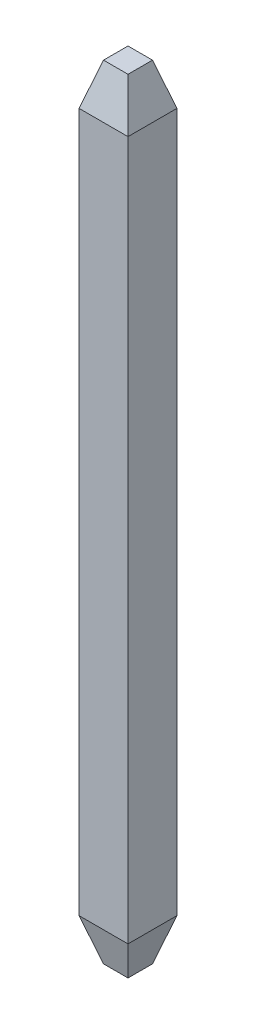
ISO-10303-21;
HEADER;
FILE_DESCRIPTION(('STEP AP214'),'2;1');
FILE_NAME('part.step','',(''),(''),'','','');
FILE_SCHEMA(('AUTOMOTIVE_DESIGN { 1 0 10303 214 1 1 1 1 }'));
ENDSEC;
DATA;
#1=APPLICATION_CONTEXT('core data for automotive mechanical design processes');
#2=APPLICATION_PROTOCOL_DEFINITION('international standard','automotive_design',2000,#1);
#3=PRODUCT_CONTEXT('',#1,'mechanical');
#4=PRODUCT('Part','Part','',(#3));
#5=PRODUCT_RELATED_PRODUCT_CATEGORY('part','',(#4));
#6=PRODUCT_DEFINITION_FORMATION('','',#4);
#7=PRODUCT_DEFINITION_CONTEXT('part definition',#1,'design');
#8=PRODUCT_DEFINITION('design','',#6,#7);
#9=PRODUCT_DEFINITION_SHAPE('','',#8);
#10=(LENGTH_UNIT() NAMED_UNIT(*) SI_UNIT(.MILLI.,.METRE.));
#11=(NAMED_UNIT(*) PLANE_ANGLE_UNIT() SI_UNIT($,.RADIAN.));
#12=(NAMED_UNIT(*) SI_UNIT($,.STERADIAN.) SOLID_ANGLE_UNIT());
#13=UNCERTAINTY_MEASURE_WITH_UNIT(LENGTH_MEASURE(1.E-05),#10,'distance_accuracy_value','');
#14=(GEOMETRIC_REPRESENTATION_CONTEXT(3) GLOBAL_UNCERTAINTY_ASSIGNED_CONTEXT((#13)) GLOBAL_UNIT_ASSIGNED_CONTEXT((#10,
#11,#12)) REPRESENTATION_CONTEXT('',''));
#15=CARTESIAN_POINT('',(0.,0.,0.));
#16=DIRECTION('',(0.,0.,1.));
#17=DIRECTION('',(1.,0.,0.));
#18=AXIS2_PLACEMENT_3D('',#15,#16,#17);
#19=CARTESIAN_POINT('',(-1.10999999998703,-10.1039999999832,-16.6599999999763));
#20=DIRECTION('',(0.,-0.281214622974643,0.959644900900968));
#21=DIRECTION('',(-1.,0.,0.));
#22=AXIS2_PLACEMENT_3D('',#19,#20,#21);
#23=PLANE('',#22);
#24=DIRECTION('',(-1.,0.,0.));
#25=VECTOR('',#24,1.);
#26=CARTESIAN_POINT('',(-0.789999999987025,-10.1039999999832,-16.6599999999763));
#27=LINE('',#26,#25);
#28=CARTESIAN_POINT('',(-0.789999999987053,-10.1039999999832,-16.6599999999763));
#29=VERTEX_POINT('',#28);
#30=CARTESIAN_POINT('',(-1.42999999998704,-10.1039999999832,-16.6599999999763));
#31=VERTEX_POINT('',#30);
#32=EDGE_CURVE('E11',#29,#31,#27,.T.);
#33=ORIENTED_EDGE('',*,*,#32,.T.);
#34=DIRECTION('',(0.270714017147727,-0.923811583516618,-0.270714017147727));
#35=VECTOR('',#34,1.);
#36=CARTESIAN_POINT('',(-1.42999999998704,-10.1039999999832,-16.6599999999763));
#37=LINE('',#36,#35);
#38=CARTESIAN_POINT('',(-1.26999999998704,-10.6499999999832,-16.8199999999763));
#39=VERTEX_POINT('',#38);
#40=EDGE_CURVE('E28',#31,#39,#37,.T.);
#41=ORIENTED_EDGE('',*,*,#40,.T.);
#42=DIRECTION('',(-1.,0.,0.));
#43=VECTOR('',#42,1.);
#44=CARTESIAN_POINT('',(-0.949999999987021,-10.6499999999832,-16.8199999999763));
#45=LINE('',#44,#43);
#46=CARTESIAN_POINT('',(-0.94999999998705,-10.6499999999832,-16.8199999999763));
#47=VERTEX_POINT('',#46);
#48=EDGE_CURVE('E113',#47,#39,#45,.T.);
#49=ORIENTED_EDGE('',*,*,#48,.F.);
#50=DIRECTION('',(-0.270714017147721,-0.923811583516619,-0.270714017147728));
#51=VECTOR('',#50,1.);
#52=CARTESIAN_POINT('',(-0.789999999987025,-10.1039999999832,-16.6599999999763));
#53=LINE('',#52,#51);
#54=EDGE_CURVE('E115',#29,#47,#53,.T.);
#55=ORIENTED_EDGE('',*,*,#54,.F.);
#56=EDGE_LOOP('',(#33,#41,#49,#55));
#57=FACE_BOUND('',#56,.T.);
#58=ADVANCED_FACE('F17',(#57),#23,.T.);
#59=CARTESIAN_POINT('',(-1.43099999998702,-5.53543505344793,-16.6599999999763));
#60=DIRECTION('',(0.,0.,1.));
#61=DIRECTION('',(1.,0.,0.));
#62=AXIS2_PLACEMENT_3D('',#59,#60,#61);
#63=PLANE('',#62);
#64=DIRECTION('',(0.,1.,0.));
#65=VECTOR('',#64,1.);
#66=CARTESIAN_POINT('',(-1.42999999998704,-10.1039999999832,-16.6599999999763));
#67=LINE('',#66,#65);
#68=CARTESIAN_POINT('',(-1.42999999998704,-0.965870106912663,-16.6599999999763));
#69=VERTEX_POINT('',#68);
#70=EDGE_CURVE('E41',#31,#69,#67,.T.);
#71=ORIENTED_EDGE('',*,*,#70,.F.);
#72=ORIENTED_EDGE('',*,*,#32,.F.);
#73=DIRECTION('',(0.,1.,0.));
#74=VECTOR('',#73,1.);
#75=CARTESIAN_POINT('',(-0.789999999987025,-10.1039999999832,-16.6599999999763));
#76=LINE('',#75,#74);
#77=CARTESIAN_POINT('',(-0.789999999987053,-0.965870106912663,-16.6599999999763));
#78=VERTEX_POINT('',#77);
#79=EDGE_CURVE('E148',#29,#78,#76,.T.);
#80=ORIENTED_EDGE('',*,*,#79,.T.);
#81=DIRECTION('',(-1.,0.,0.));
#82=VECTOR('',#81,1.);
#83=CARTESIAN_POINT('',(-0.789999999987025,-0.965870106912661,-16.6599999999763));
#84=LINE('',#83,#82);
#85=EDGE_CURVE('E145',#78,#69,#84,.T.);
#86=ORIENTED_EDGE('',*,*,#85,.T.);
#87=EDGE_LOOP('',(#71,#72,#80,#86));
#88=FACE_BOUND('',#87,.T.);
#89=ADVANCED_FACE('F231',(#88),#63,.T.);
#90=CARTESIAN_POINT('',(-1.42999999998704,-5.53543505344793,-16.6589999999763));
#91=DIRECTION('',(-1.,0.,0.));
#92=DIRECTION('',(0.,0.,1.));
#93=AXIS2_PLACEMENT_3D('',#90,#91,#92);
#94=PLANE('',#93);
#95=DIRECTION('',(0.,1.,0.));
#96=VECTOR('',#95,1.);
#97=CARTESIAN_POINT('',(-1.42999999998704,-10.1039999999832,-17.2999999999763));
#98=LINE('',#97,#96);
#99=CARTESIAN_POINT('',(-1.42999999998704,-10.1039999999832,-17.2999999999763));
#100=VERTEX_POINT('',#99);
#101=CARTESIAN_POINT('',(-1.42999999998704,-0.965870106912663,-17.2999999999763));
#102=VERTEX_POINT('',#101);
#103=EDGE_CURVE('E165',#100,#102,#98,.T.);
#104=ORIENTED_EDGE('',*,*,#103,.F.);
#105=DIRECTION('',(0.,0.,-1.));
#106=VECTOR('',#105,1.);
#107=CARTESIAN_POINT('',(-1.42999999998704,-10.1039999999832,-16.6599999999763));
#108=LINE('',#107,#106);
#109=EDGE_CURVE('E154',#31,#100,#108,.T.);
#110=ORIENTED_EDGE('',*,*,#109,.F.);
#111=ORIENTED_EDGE('',*,*,#70,.T.);
#112=DIRECTION('',(0.,0.,-1.));
#113=VECTOR('',#112,1.);
#114=CARTESIAN_POINT('',(-1.42999999998704,-0.965870106912661,-16.6599999999763));
#115=LINE('',#114,#113);
#116=EDGE_CURVE('E169',#69,#102,#115,.T.);
#117=ORIENTED_EDGE('',*,*,#116,.T.);
#118=EDGE_LOOP('',(#104,#110,#111,#117));
#119=FACE_BOUND('',#118,.T.);
#120=ADVANCED_FACE('F19',(#119),#94,.T.);
#121=CARTESIAN_POINT('',(-0.78899999998702,-5.53443505344793,-17.2999999999763));
#122=DIRECTION('',(0.,0.,-1.));
#123=DIRECTION('',(0.,-1.,0.));
#124=AXIS2_PLACEMENT_3D('',#121,#122,#123);
#125=PLANE('',#124);
#126=DIRECTION('',(0.,1.,0.));
#127=VECTOR('',#126,1.);
#128=CARTESIAN_POINT('',(-0.789999999987025,-10.1039999999832,-17.2999999999763));
#129=LINE('',#128,#127);
#130=CARTESIAN_POINT('',(-0.789999999987053,-10.1039999999832,-17.2999999999763));
#131=VERTEX_POINT('',#130);
#132=CARTESIAN_POINT('',(-0.789999999987053,-0.965870106912663,-17.2999999999763));
#133=VERTEX_POINT('',#132);
#134=EDGE_CURVE('E144',#131,#133,#129,.T.);
#135=ORIENTED_EDGE('',*,*,#134,.F.);
#136=DIRECTION('',(1.,0.,0.));
#137=VECTOR('',#136,1.);
#138=CARTESIAN_POINT('',(-1.42999999998704,-10.1039999999832,-17.2999999999763));
#139=LINE('',#138,#137);
#140=EDGE_CURVE('E174',#100,#131,#139,.T.);
#141=ORIENTED_EDGE('',*,*,#140,.F.);
#142=ORIENTED_EDGE('',*,*,#103,.T.);
#143=DIRECTION('',(1.,0.,0.));
#144=VECTOR('',#143,1.);
#145=CARTESIAN_POINT('',(-1.42999999998704,-0.965870106912661,-17.2999999999763));
#146=LINE('',#145,#144);
#147=EDGE_CURVE('E170',#102,#133,#146,.T.);
#148=ORIENTED_EDGE('',*,*,#147,.T.);
#149=EDGE_LOOP('',(#135,#141,#142,#148));
#150=FACE_BOUND('',#149,.T.);
#151=ADVANCED_FACE('F241',(#150),#125,.T.);
#152=CARTESIAN_POINT('',(-1.10999999998703,-0.965870106912661,-17.2999999999763));
#153=DIRECTION('',(0.,0.281214622974643,-0.959644900900968));
#154=DIRECTION('',(-1.,0.,0.));
#155=AXIS2_PLACEMENT_3D('',#152,#153,#154);
#156=PLANE('',#155);
#157=DIRECTION('',(0.270714017147727,0.923811583516618,0.270714017147727));
#158=VECTOR('',#157,1.);
#159=CARTESIAN_POINT('',(-1.42999999998704,-0.965870106912661,-17.2999999999763));
#160=LINE('',#159,#158);
#161=CARTESIAN_POINT('',(-1.26999999998704,-0.419870106912663,-17.1399999999763));
#162=VERTEX_POINT('',#161);
#163=EDGE_CURVE('E163',#102,#162,#160,.T.);
#164=ORIENTED_EDGE('',*,*,#163,.T.);
#165=DIRECTION('',(1.,0.,0.));
#166=VECTOR('',#165,1.);
#167=CARTESIAN_POINT('',(-1.26999999998704,-0.419870106912661,-17.1399999999763));
#168=LINE('',#167,#166);
#169=CARTESIAN_POINT('',(-0.94999999998705,-0.419870106912663,-17.1399999999763));
#170=VERTEX_POINT('',#169);
#171=EDGE_CURVE('E159',#162,#170,#168,.T.);
#172=ORIENTED_EDGE('',*,*,#171,.T.);
#173=DIRECTION('',(-0.270714017147721,0.923811583516619,0.270714017147728));
#174=VECTOR('',#173,1.);
#175=CARTESIAN_POINT('',(-0.789999999987025,-0.965870106912661,-17.2999999999763));
#176=LINE('',#175,#174);
#177=EDGE_CURVE('E164',#133,#170,#176,.T.);
#178=ORIENTED_EDGE('',*,*,#177,.F.);
#179=ORIENTED_EDGE('',*,*,#147,.F.);
#180=EDGE_LOOP('',(#164,#172,#178,#179));
#181=FACE_BOUND('',#180,.T.);
#182=ADVANCED_FACE('F240',(#181),#156,.T.);
#183=CARTESIAN_POINT('',(-0.789999999987025,-0.965870106912661,-16.9799999999763));
#184=DIRECTION('',(0.95964490090097,0.281214622974637,0.));
#185=DIRECTION('',(0.,0.,-1.));
#186=AXIS2_PLACEMENT_3D('',#183,#184,#185);
#187=PLANE('',#186);
#188=ORIENTED_EDGE('',*,*,#177,.T.);
#189=DIRECTION('',(0.,0.,1.));
#190=VECTOR('',#189,1.);
#191=CARTESIAN_POINT('',(-0.949999999987021,-0.419870106912661,-17.1399999999763));
#192=LINE('',#191,#190);
#193=CARTESIAN_POINT('',(-0.94999999998705,-0.419870106912663,-16.8199999999763));
#194=VERTEX_POINT('',#193);
#195=EDGE_CURVE('E173',#170,#194,#192,.T.);
#196=ORIENTED_EDGE('',*,*,#195,.T.);
#197=DIRECTION('',(-0.270714017147721,0.923811583516619,-0.270714017147728));
#198=VECTOR('',#197,1.);
#199=CARTESIAN_POINT('',(-0.789999999987025,-0.965870106912661,-16.6599999999763));
#200=LINE('',#199,#198);
#201=EDGE_CURVE('E21',#78,#194,#200,.T.);
#202=ORIENTED_EDGE('',*,*,#201,.F.);
#203=DIRECTION('',(0.,0.,1.));
#204=VECTOR('',#203,1.);
#205=CARTESIAN_POINT('',(-0.789999999987025,-0.965870106912661,-17.2999999999763));
#206=LINE('',#205,#204);
#207=EDGE_CURVE('E140',#133,#78,#206,.T.);
#208=ORIENTED_EDGE('',*,*,#207,.F.);
#209=EDGE_LOOP('',(#188,#196,#202,#208));
#210=FACE_BOUND('',#209,.T.);
#211=ADVANCED_FACE('F205',(#210),#187,.T.);
#212=CARTESIAN_POINT('',(-1.10999999998703,-0.419870106912661,-17.1409999999763));
#213=DIRECTION('',(0.,1.,0.));
#214=DIRECTION('',(1.,0.,0.));
#215=AXIS2_PLACEMENT_3D('',#212,#213,#214);
#216=PLANE('',#215);
#217=ORIENTED_EDGE('',*,*,#171,.F.);
#218=DIRECTION('',(0.,0.,-1.));
#219=VECTOR('',#218,1.);
#220=CARTESIAN_POINT('',(-1.26999999998704,-0.419870106912661,-16.8199999999763));
#221=LINE('',#220,#219);
#222=CARTESIAN_POINT('',(-1.26999999998704,-0.419870106912663,-16.8199999999763));
#223=VERTEX_POINT('',#222);
#224=EDGE_CURVE('E138',#223,#162,#221,.T.);
#225=ORIENTED_EDGE('',*,*,#224,.F.);
#226=DIRECTION('',(-1.,0.,0.));
#227=VECTOR('',#226,1.);
#228=CARTESIAN_POINT('',(-0.949999999987021,-0.419870106912661,-16.8199999999763));
#229=LINE('',#228,#227);
#230=EDGE_CURVE('E181',#194,#223,#229,.T.);
#231=ORIENTED_EDGE('',*,*,#230,.F.);
#232=ORIENTED_EDGE('',*,*,#195,.F.);
#233=EDGE_LOOP('',(#217,#225,#231,#232));
#234=FACE_BOUND('',#233,.T.);
#235=ADVANCED_FACE('F211',(#234),#216,.T.);
#236=CARTESIAN_POINT('',(-1.10999999998703,-10.1039999999832,-17.2999999999763));
#237=DIRECTION('',(0.,-0.281214622974643,-0.959644900900968));
#238=DIRECTION('',(0.,-0.959644900900968,0.281214622974643));
#239=AXIS2_PLACEMENT_3D('',#236,#237,#238);
#240=PLANE('',#239);
#241=ORIENTED_EDGE('',*,*,#140,.T.);
#242=DIRECTION('',(-0.270714017147721,-0.923811583516619,0.270714017147728));
#243=VECTOR('',#242,1.);
#244=CARTESIAN_POINT('',(-0.789999999987025,-10.1039999999832,-17.2999999999763));
#245=LINE('',#244,#243);
#246=CARTESIAN_POINT('',(-0.94999999998705,-10.6499999999832,-17.1399999999763));
#247=VERTEX_POINT('',#246);
#248=EDGE_CURVE('E153',#131,#247,#245,.T.);
#249=ORIENTED_EDGE('',*,*,#248,.T.);
#250=DIRECTION('',(1.,0.,0.));
#251=VECTOR('',#250,1.);
#252=CARTESIAN_POINT('',(-1.26999999998704,-10.6499999999832,-17.1399999999763));
#253=LINE('',#252,#251);
#254=CARTESIAN_POINT('',(-1.26999999998704,-10.6499999999832,-17.1399999999763));
#255=VERTEX_POINT('',#254);
#256=EDGE_CURVE('E88',#255,#247,#253,.T.);
#257=ORIENTED_EDGE('',*,*,#256,.F.);
#258=DIRECTION('',(0.270714017147727,-0.923811583516618,0.270714017147727));
#259=VECTOR('',#258,1.);
#260=CARTESIAN_POINT('',(-1.42999999998704,-10.1039999999832,-17.2999999999763));
#261=LINE('',#260,#259);
#262=EDGE_CURVE('E79',#100,#255,#261,.T.);
#263=ORIENTED_EDGE('',*,*,#262,.F.);
#264=EDGE_LOOP('',(#241,#249,#257,#263));
#265=FACE_BOUND('',#264,.T.);
#266=ADVANCED_FACE('F243',(#265),#240,.T.);
#267=CARTESIAN_POINT('',(-1.42999999998704,-0.965870106912661,-16.9799999999763));
#268=DIRECTION('',(-0.959644900900968,0.281214622974643,0.));
#269=DIRECTION('',(0.,0.,1.));
#270=AXIS2_PLACEMENT_3D('',#267,#268,#269);
#271=PLANE('',#270);
#272=DIRECTION('',(0.270714017147727,0.923811583516618,-0.270714017147727));
#273=VECTOR('',#272,1.);
#274=CARTESIAN_POINT('',(-1.42999999998704,-0.965870106912661,-16.6599999999763));
#275=LINE('',#274,#273);
#276=EDGE_CURVE('E149',#69,#223,#275,.T.);
#277=ORIENTED_EDGE('',*,*,#276,.T.);
#278=ORIENTED_EDGE('',*,*,#224,.T.);
#279=ORIENTED_EDGE('',*,*,#163,.F.);
#280=ORIENTED_EDGE('',*,*,#116,.F.);
#281=EDGE_LOOP('',(#277,#278,#279,#280));
#282=FACE_BOUND('',#281,.T.);
#283=ADVANCED_FACE('F224',(#282),#271,.T.);
#284=CARTESIAN_POINT('',(-1.10999999998703,-0.965870106912661,-16.6599999999763));
#285=DIRECTION('',(0.,0.281214622974643,0.959644900900968));
#286=DIRECTION('',(1.,0.,0.));
#287=AXIS2_PLACEMENT_3D('',#284,#285,#286);
#288=PLANE('',#287);
#289=ORIENTED_EDGE('',*,*,#201,.T.);
#290=ORIENTED_EDGE('',*,*,#230,.T.);
#291=ORIENTED_EDGE('',*,*,#276,.F.);
#292=ORIENTED_EDGE('',*,*,#85,.F.);
#293=EDGE_LOOP('',(#289,#290,#291,#292));
#294=FACE_BOUND('',#293,.T.);
#295=ADVANCED_FACE('F215',(#294),#288,.T.);
#296=CARTESIAN_POINT('',(-0.789999999987025,-11.0738701069127,-16.9799999999763));
#297=DIRECTION('',(1.,0.,0.));
#298=DIRECTION('',(0.,1.,0.));
#299=AXIS2_PLACEMENT_3D('',#296,#297,#298);
#300=PLANE('',#299);
#301=ORIENTED_EDGE('',*,*,#79,.F.);
#302=DIRECTION('',(0.,0.,1.));
#303=VECTOR('',#302,1.);
#304=CARTESIAN_POINT('',(-0.789999999987025,-10.1039999999832,-17.2999999999763));
#305=LINE('',#304,#303);
#306=EDGE_CURVE('E127',#131,#29,#305,.T.);
#307=ORIENTED_EDGE('',*,*,#306,.F.);
#308=ORIENTED_EDGE('',*,*,#134,.T.);
#309=ORIENTED_EDGE('',*,*,#207,.T.);
#310=EDGE_LOOP('',(#301,#307,#308,#309));
#311=FACE_BOUND('',#310,.T.);
#312=ADVANCED_FACE('F233',(#311),#300,.T.);
#313=CARTESIAN_POINT('',(-0.789999999987025,-10.1039999999832,-16.9799999999763));
#314=DIRECTION('',(0.95964490090097,-0.281214622974637,0.));
#315=DIRECTION('',(0.,0.,-1.));
#316=AXIS2_PLACEMENT_3D('',#313,#314,#315);
#317=PLANE('',#316);
#318=ORIENTED_EDGE('',*,*,#306,.T.);
#319=ORIENTED_EDGE('',*,*,#54,.T.);
#320=DIRECTION('',(0.,0.,1.));
#321=VECTOR('',#320,1.);
#322=CARTESIAN_POINT('',(-0.949999999987021,-10.6499999999832,-17.1399999999763));
#323=LINE('',#322,#321);
#324=EDGE_CURVE('E118',#247,#47,#323,.T.);
#325=ORIENTED_EDGE('',*,*,#324,.F.);
#326=ORIENTED_EDGE('',*,*,#248,.F.);
#327=EDGE_LOOP('',(#318,#319,#325,#326));
#328=FACE_BOUND('',#327,.T.);
#329=ADVANCED_FACE('F124',(#328),#317,.T.);
#330=CARTESIAN_POINT('',(-1.27099999998702,-10.6499999999832,-16.9799999999763));
#331=DIRECTION('',(0.,-1.,0.));
#332=DIRECTION('',(0.,0.,-1.));
#333=AXIS2_PLACEMENT_3D('',#330,#331,#332);
#334=PLANE('',#333);
#335=ORIENTED_EDGE('',*,*,#324,.T.);
#336=ORIENTED_EDGE('',*,*,#48,.T.);
#337=DIRECTION('',(0.,0.,-1.));
#338=VECTOR('',#337,1.);
#339=CARTESIAN_POINT('',(-1.26999999998704,-10.6499999999832,-16.8199999999763));
#340=LINE('',#339,#338);
#341=EDGE_CURVE('E119',#39,#255,#340,.T.);
#342=ORIENTED_EDGE('',*,*,#341,.T.);
#343=ORIENTED_EDGE('',*,*,#256,.T.);
#344=EDGE_LOOP('',(#335,#336,#342,#343));
#345=FACE_BOUND('',#344,.T.);
#346=ADVANCED_FACE('F130',(#345),#334,.T.);
#347=CARTESIAN_POINT('',(-1.42999999998704,-10.1039999999832,-16.9799999999763));
#348=DIRECTION('',(-0.959644900900968,-0.281214622974643,0.));
#349=DIRECTION('',(-0.281214622974643,0.959644900900968,0.));
#350=AXIS2_PLACEMENT_3D('',#347,#348,#349);
#351=PLANE('',#350);
#352=ORIENTED_EDGE('',*,*,#109,.T.);
#353=ORIENTED_EDGE('',*,*,#262,.T.);
#354=ORIENTED_EDGE('',*,*,#341,.F.);
#355=ORIENTED_EDGE('',*,*,#40,.F.);
#356=EDGE_LOOP('',(#352,#353,#354,#355));
#357=FACE_BOUND('',#356,.T.);
#358=ADVANCED_FACE('F358',(#357),#351,.T.);
#359=CLOSED_SHELL('',(#58,#89,#120,#151,#182,#211,#235,#266,#283,#295,#312,#329,#346,#358));
#360=MANIFOLD_SOLID_BREP('B1',#359);
#361=ADVANCED_BREP_SHAPE_REPRESENTATION('',(#18,#360),#14);
#362=SHAPE_DEFINITION_REPRESENTATION(#9,#361);
ENDSEC;
END-ISO-10303-21;
